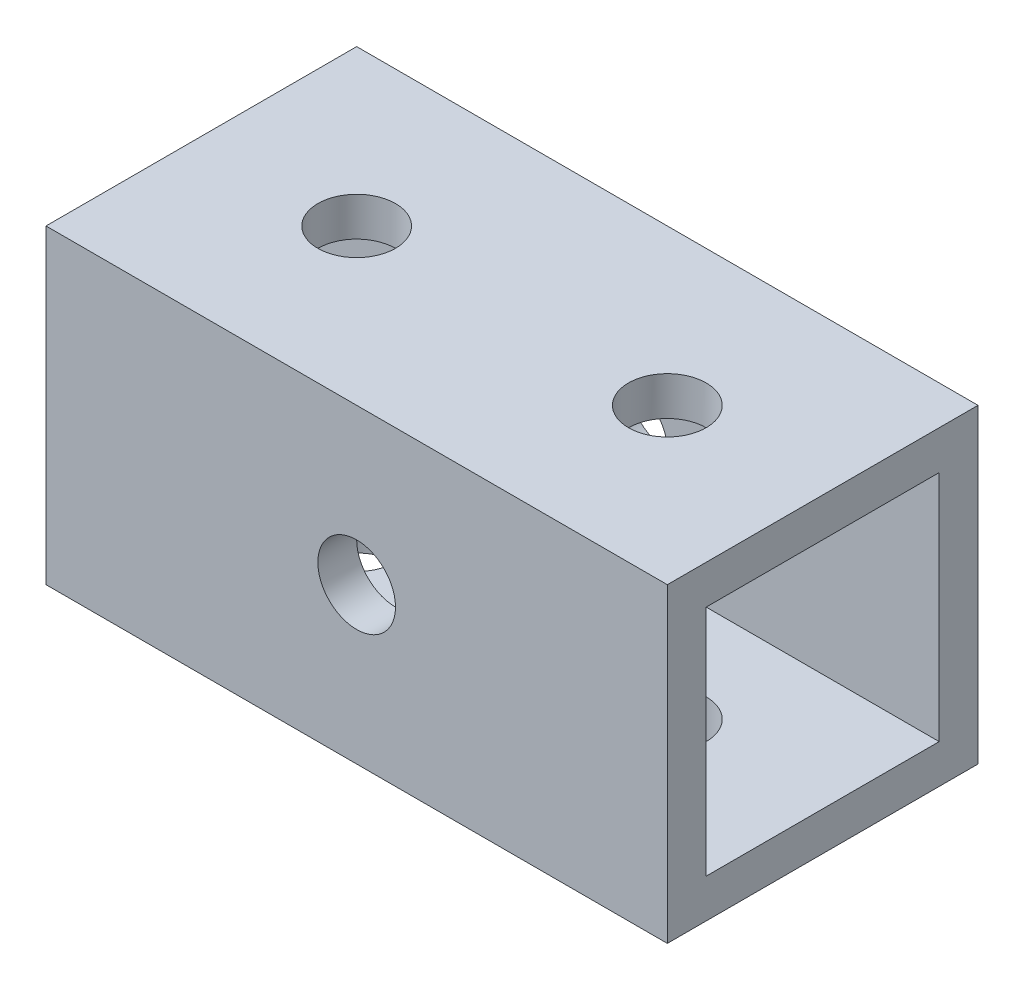
ISO-10303-21;
HEADER;
FILE_DESCRIPTION(('STEP AP214'),'2;1');
FILE_NAME('part.step','',(''),(''),'','','');
FILE_SCHEMA(('AUTOMOTIVE_DESIGN { 1 0 10303 214 1 1 1 1 }'));
ENDSEC;
DATA;
#1=APPLICATION_CONTEXT('core data for automotive mechanical design processes');
#2=APPLICATION_PROTOCOL_DEFINITION('international standard','automotive_design',2000,#1);
#3=PRODUCT_CONTEXT('',#1,'mechanical');
#4=PRODUCT('Part','Part','',(#3));
#5=PRODUCT_RELATED_PRODUCT_CATEGORY('part','',(#4));
#6=PRODUCT_DEFINITION_FORMATION('','',#4);
#7=PRODUCT_DEFINITION_CONTEXT('part definition',#1,'design');
#8=PRODUCT_DEFINITION('design','',#6,#7);
#9=PRODUCT_DEFINITION_SHAPE('','',#8);
#10=(LENGTH_UNIT() NAMED_UNIT(*) SI_UNIT(.MILLI.,.METRE.));
#11=(NAMED_UNIT(*) PLANE_ANGLE_UNIT() SI_UNIT($,.RADIAN.));
#12=(NAMED_UNIT(*) SI_UNIT($,.STERADIAN.) SOLID_ANGLE_UNIT());
#13=UNCERTAINTY_MEASURE_WITH_UNIT(LENGTH_MEASURE(1.E-05),#10,'distance_accuracy_value','');
#14=(GEOMETRIC_REPRESENTATION_CONTEXT(3) GLOBAL_UNCERTAINTY_ASSIGNED_CONTEXT((#13)) GLOBAL_UNIT_ASSIGNED_CONTEXT((#10,
#11,#12)) REPRESENTATION_CONTEXT('',''));
#15=CARTESIAN_POINT('',(0.,0.,0.));
#16=DIRECTION('',(0.,0.,1.));
#17=DIRECTION('',(1.,0.,0.));
#18=AXIS2_PLACEMENT_3D('',#15,#16,#17);
#19=CARTESIAN_POINT('',(50.8,25.4,0.));
#20=DIRECTION('',(-1.,0.,0.));
#21=DIRECTION('',(0.,0.,1.));
#22=AXIS2_PLACEMENT_3D('',#19,#20,#21);
#23=PLANE('',#22);
#24=DIRECTION('',(0.,-1.,0.));
#25=VECTOR('',#24,1.);
#26=CARTESIAN_POINT('',(50.8,0.,0.));
#27=LINE('',#26,#25);
#28=CARTESIAN_POINT('',(50.8,25.4,0.));
#29=VERTEX_POINT('',#28);
#30=CARTESIAN_POINT('',(50.8,0.,0.));
#31=VERTEX_POINT('',#30);
#32=EDGE_CURVE('E147',#29,#31,#27,.T.);
#33=ORIENTED_EDGE('',*,*,#32,.T.);
#34=DIRECTION('',(0.,0.,-1.));
#35=VECTOR('',#34,1.);
#36=CARTESIAN_POINT('',(50.8,0.,0.));
#37=LINE('',#36,#35);
#38=CARTESIAN_POINT('',(50.8,0.,-25.4));
#39=VERTEX_POINT('',#38);
#40=EDGE_CURVE('E150',#31,#39,#37,.T.);
#41=ORIENTED_EDGE('',*,*,#40,.T.);
#42=DIRECTION('',(0.,1.,0.));
#43=VECTOR('',#42,1.);
#44=CARTESIAN_POINT('',(50.8,0.,-25.4));
#45=LINE('',#44,#43);
#46=CARTESIAN_POINT('',(50.8,25.4,-25.4));
#47=VERTEX_POINT('',#46);
#48=EDGE_CURVE('E152',#39,#47,#45,.T.);
#49=ORIENTED_EDGE('',*,*,#48,.T.);
#50=DIRECTION('',(0.,0.,1.));
#51=VECTOR('',#50,1.);
#52=CARTESIAN_POINT('',(50.8,25.4,0.));
#53=LINE('',#52,#51);
#54=EDGE_CURVE('E154',#47,#29,#53,.T.);
#55=ORIENTED_EDGE('',*,*,#54,.T.);
#56=EDGE_LOOP('',(#33,#41,#49,#55));
#57=FACE_BOUND('',#56,.T.);
#58=DIRECTION('',(0.,-1.,0.));
#59=VECTOR('',#58,1.);
#60=CARTESIAN_POINT('',(50.8,3.175,-3.175));
#61=LINE('',#60,#59);
#62=CARTESIAN_POINT('',(50.8,22.225,-3.175));
#63=VERTEX_POINT('',#62);
#64=CARTESIAN_POINT('',(50.8,3.175,-3.175));
#65=VERTEX_POINT('',#64);
#66=EDGE_CURVE('E113',#63,#65,#61,.T.);
#67=ORIENTED_EDGE('',*,*,#66,.F.);
#68=DIRECTION('',(0.,0.,1.));
#69=VECTOR('',#68,1.);
#70=CARTESIAN_POINT('',(50.8,22.225,-3.175));
#71=LINE('',#70,#69);
#72=CARTESIAN_POINT('',(50.8,22.225,-22.225));
#73=VERTEX_POINT('',#72);
#74=EDGE_CURVE('E133',#73,#63,#71,.T.);
#75=ORIENTED_EDGE('',*,*,#74,.F.);
#76=DIRECTION('',(0.,1.,0.));
#77=VECTOR('',#76,1.);
#78=CARTESIAN_POINT('',(50.8,3.175,-22.225));
#79=LINE('',#78,#77);
#80=CARTESIAN_POINT('',(50.8,3.175,-22.225));
#81=VERTEX_POINT('',#80);
#82=EDGE_CURVE('E131',#81,#73,#79,.T.);
#83=ORIENTED_EDGE('',*,*,#82,.F.);
#84=DIRECTION('',(0.,0.,-1.));
#85=VECTOR('',#84,1.);
#86=CARTESIAN_POINT('',(50.8,3.175,-3.175));
#87=LINE('',#86,#85);
#88=EDGE_CURVE('E129',#65,#81,#87,.T.);
#89=ORIENTED_EDGE('',*,*,#88,.F.);
#90=EDGE_LOOP('',(#67,#75,#83,#89));
#91=FACE_BOUND('',#90,.T.);
#92=ADVANCED_FACE('F31',(#57,#91),#23,.F.);
#93=CARTESIAN_POINT('',(0.,25.4,0.));
#94=DIRECTION('',(-1.,0.,0.));
#95=DIRECTION('',(0.,0.,1.));
#96=AXIS2_PLACEMENT_3D('',#93,#94,#95);
#97=PLANE('',#96);
#98=DIRECTION('',(0.,-1.,0.));
#99=VECTOR('',#98,1.);
#100=CARTESIAN_POINT('',(0.,0.,0.));
#101=LINE('',#100,#99);
#102=CARTESIAN_POINT('',(0.,25.4,0.));
#103=VERTEX_POINT('',#102);
#104=CARTESIAN_POINT('',(0.,0.,0.));
#105=VERTEX_POINT('',#104);
#106=EDGE_CURVE('E114',#103,#105,#101,.T.);
#107=ORIENTED_EDGE('',*,*,#106,.F.);
#108=DIRECTION('',(0.,0.,1.));
#109=VECTOR('',#108,1.);
#110=CARTESIAN_POINT('',(0.,25.4,0.));
#111=LINE('',#110,#109);
#112=CARTESIAN_POINT('',(0.,25.4,-25.4));
#113=VERTEX_POINT('',#112);
#114=EDGE_CURVE('E145',#113,#103,#111,.T.);
#115=ORIENTED_EDGE('',*,*,#114,.F.);
#116=DIRECTION('',(0.,1.,0.));
#117=VECTOR('',#116,1.);
#118=CARTESIAN_POINT('',(0.,0.,-25.4));
#119=LINE('',#118,#117);
#120=CARTESIAN_POINT('',(0.,0.,-25.4));
#121=VERTEX_POINT('',#120);
#122=EDGE_CURVE('E143',#121,#113,#119,.T.);
#123=ORIENTED_EDGE('',*,*,#122,.F.);
#124=DIRECTION('',(0.,0.,-1.));
#125=VECTOR('',#124,1.);
#126=CARTESIAN_POINT('',(0.,0.,0.));
#127=LINE('',#126,#125);
#128=EDGE_CURVE('E141',#105,#121,#127,.T.);
#129=ORIENTED_EDGE('',*,*,#128,.F.);
#130=EDGE_LOOP('',(#107,#115,#123,#129));
#131=FACE_BOUND('',#130,.T.);
#132=DIRECTION('',(0.,0.,1.));
#133=VECTOR('',#132,1.);
#134=CARTESIAN_POINT('',(0.,22.225,-3.175));
#135=LINE('',#134,#133);
#136=CARTESIAN_POINT('',(0.,22.225,-22.225));
#137=VERTEX_POINT('',#136);
#138=CARTESIAN_POINT('',(0.,22.225,-3.175));
#139=VERTEX_POINT('',#138);
#140=EDGE_CURVE('E118',#137,#139,#135,.T.);
#141=ORIENTED_EDGE('',*,*,#140,.T.);
#142=DIRECTION('',(0.,-1.,0.));
#143=VECTOR('',#142,1.);
#144=CARTESIAN_POINT('',(0.,3.175,-3.175));
#145=LINE('',#144,#143);
#146=CARTESIAN_POINT('',(0.,3.175,-3.175));
#147=VERTEX_POINT('',#146);
#148=EDGE_CURVE('E56',#139,#147,#145,.T.);
#149=ORIENTED_EDGE('',*,*,#148,.T.);
#150=DIRECTION('',(0.,0.,-1.));
#151=VECTOR('',#150,1.);
#152=CARTESIAN_POINT('',(0.,3.175,-3.175));
#153=LINE('',#152,#151);
#154=CARTESIAN_POINT('',(0.,3.175,-22.225));
#155=VERTEX_POINT('',#154);
#156=EDGE_CURVE('E100',#147,#155,#153,.T.);
#157=ORIENTED_EDGE('',*,*,#156,.T.);
#158=DIRECTION('',(0.,1.,0.));
#159=VECTOR('',#158,1.);
#160=CARTESIAN_POINT('',(0.,3.175,-22.225));
#161=LINE('',#160,#159);
#162=EDGE_CURVE('E109',#155,#137,#161,.T.);
#163=ORIENTED_EDGE('',*,*,#162,.T.);
#164=EDGE_LOOP('',(#141,#149,#157,#163));
#165=FACE_BOUND('',#164,.T.);
#166=ADVANCED_FACE('F117',(#131,#165),#97,.T.);
#167=CARTESIAN_POINT('',(50.8,0.,0.));
#168=DIRECTION('',(0.,0.,-1.));
#169=DIRECTION('',(0.,1.,0.));
#170=AXIS2_PLACEMENT_3D('',#167,#168,#169);
#171=PLANE('',#170);
#172=CARTESIAN_POINT('',(25.4,12.7,0.));
#173=DIRECTION('',(0.,0.,1.));
#174=DIRECTION('',(1.,0.,0.));
#175=AXIS2_PLACEMENT_3D('',#172,#173,#174);
#176=CIRCLE('',#175,3.175);
#177=CARTESIAN_POINT('',(28.575,12.7,0.));
#178=VERTEX_POINT('',#177);
#179=EDGE_CURVE('E173',#178,#178,#176,.T.);
#180=ORIENTED_EDGE('',*,*,#179,.F.);
#181=EDGE_LOOP('',(#180));
#182=FACE_BOUND('',#181,.T.);
#183=ORIENTED_EDGE('',*,*,#106,.T.);
#184=DIRECTION('',(-1.,0.,0.));
#185=VECTOR('',#184,1.);
#186=CARTESIAN_POINT('',(50.8,0.,0.));
#187=LINE('',#186,#185);
#188=EDGE_CURVE('E11',#31,#105,#187,.T.);
#189=ORIENTED_EDGE('',*,*,#188,.F.);
#190=ORIENTED_EDGE('',*,*,#32,.F.);
#191=DIRECTION('',(-1.,0.,0.));
#192=VECTOR('',#191,1.);
#193=CARTESIAN_POINT('',(50.8,25.4,0.));
#194=LINE('',#193,#192);
#195=EDGE_CURVE('E156',#29,#103,#194,.T.);
#196=ORIENTED_EDGE('',*,*,#195,.T.);
#197=EDGE_LOOP('',(#183,#189,#190,#196));
#198=FACE_BOUND('',#197,.T.);
#199=ADVANCED_FACE('F33',(#182,#198),#171,.F.);
#200=CARTESIAN_POINT('',(50.8,0.,0.));
#201=DIRECTION('',(0.,1.,0.));
#202=DIRECTION('',(0.,0.,1.));
#203=AXIS2_PLACEMENT_3D('',#200,#201,#202);
#204=PLANE('',#203);
#205=CARTESIAN_POINT('',(12.7,0.,-12.7));
#206=DIRECTION('',(0.,1.,0.));
#207=DIRECTION('',(0.,0.,-1.));
#208=AXIS2_PLACEMENT_3D('',#205,#206,#207);
#209=CIRCLE('',#208,3.175);
#210=CARTESIAN_POINT('',(12.7,0.,-15.875));
#211=VERTEX_POINT('',#210);
#212=EDGE_CURVE('E233',#211,#211,#209,.T.);
#213=ORIENTED_EDGE('',*,*,#212,.T.);
#214=EDGE_LOOP('',(#213));
#215=FACE_BOUND('',#214,.T.);
#216=CARTESIAN_POINT('',(38.1,0.,-12.7));
#217=DIRECTION('',(0.,1.,0.));
#218=DIRECTION('',(0.,0.,1.));
#219=AXIS2_PLACEMENT_3D('',#216,#217,#218);
#220=CIRCLE('',#219,3.175);
#221=CARTESIAN_POINT('',(38.1,0.,-9.525));
#222=VERTEX_POINT('',#221);
#223=EDGE_CURVE('E169',#222,#222,#220,.T.);
#224=ORIENTED_EDGE('',*,*,#223,.T.);
#225=EDGE_LOOP('',(#224));
#226=FACE_BOUND('',#225,.T.);
#227=ORIENTED_EDGE('',*,*,#128,.T.);
#228=DIRECTION('',(-1.,0.,0.));
#229=VECTOR('',#228,1.);
#230=CARTESIAN_POINT('',(50.8,0.,-25.4));
#231=LINE('',#230,#229);
#232=EDGE_CURVE('E40',#39,#121,#231,.T.);
#233=ORIENTED_EDGE('',*,*,#232,.F.);
#234=ORIENTED_EDGE('',*,*,#40,.F.);
#235=ORIENTED_EDGE('',*,*,#188,.T.);
#236=EDGE_LOOP('',(#227,#233,#234,#235));
#237=FACE_BOUND('',#236,.T.);
#238=ADVANCED_FACE('F224',(#215,#226,#237),#204,.F.);
#239=CARTESIAN_POINT('',(50.8,0.,-25.4));
#240=DIRECTION('',(0.,0.,1.));
#241=DIRECTION('',(0.,-1.,0.));
#242=AXIS2_PLACEMENT_3D('',#239,#240,#241);
#243=PLANE('',#242);
#244=CARTESIAN_POINT('',(25.4,12.7,-25.4));
#245=DIRECTION('',(0.,0.,1.));
#246=DIRECTION('',(1.,0.,0.));
#247=AXIS2_PLACEMENT_3D('',#244,#245,#246);
#248=CIRCLE('',#247,3.175);
#249=CARTESIAN_POINT('',(28.575,12.7,-25.4));
#250=VERTEX_POINT('',#249);
#251=EDGE_CURVE('E165',#250,#250,#248,.T.);
#252=ORIENTED_EDGE('',*,*,#251,.T.);
#253=EDGE_LOOP('',(#252));
#254=FACE_BOUND('',#253,.T.);
#255=ORIENTED_EDGE('',*,*,#122,.T.);
#256=DIRECTION('',(-1.,0.,0.));
#257=VECTOR('',#256,1.);
#258=CARTESIAN_POINT('',(50.8,25.4,-25.4));
#259=LINE('',#258,#257);
#260=EDGE_CURVE('E159',#47,#113,#259,.T.);
#261=ORIENTED_EDGE('',*,*,#260,.F.);
#262=ORIENTED_EDGE('',*,*,#48,.F.);
#263=ORIENTED_EDGE('',*,*,#232,.T.);
#264=EDGE_LOOP('',(#255,#261,#262,#263));
#265=FACE_BOUND('',#264,.T.);
#266=ADVANCED_FACE('F189',(#254,#265),#243,.F.);
#267=CARTESIAN_POINT('',(50.8,25.4,0.));
#268=DIRECTION('',(0.,-1.,0.));
#269=DIRECTION('',(0.,0.,-1.));
#270=AXIS2_PLACEMENT_3D('',#267,#268,#269);
#271=PLANE('',#270);
#272=CARTESIAN_POINT('',(12.7,25.4,-12.7));
#273=DIRECTION('',(0.,1.,0.));
#274=DIRECTION('',(0.,0.,-1.));
#275=AXIS2_PLACEMENT_3D('',#272,#273,#274);
#276=CIRCLE('',#275,3.175);
#277=CARTESIAN_POINT('',(12.7,25.4,-15.875));
#278=VERTEX_POINT('',#277);
#279=EDGE_CURVE('E248',#278,#278,#276,.T.);
#280=ORIENTED_EDGE('',*,*,#279,.F.);
#281=EDGE_LOOP('',(#280));
#282=FACE_BOUND('',#281,.T.);
#283=CARTESIAN_POINT('',(38.1,25.4,-12.7));
#284=DIRECTION('',(0.,1.,0.));
#285=DIRECTION('',(0.,0.,1.));
#286=AXIS2_PLACEMENT_3D('',#283,#284,#285);
#287=CIRCLE('',#286,3.175);
#288=CARTESIAN_POINT('',(38.1,25.4,-9.525));
#289=VERTEX_POINT('',#288);
#290=EDGE_CURVE('E176',#289,#289,#287,.T.);
#291=ORIENTED_EDGE('',*,*,#290,.F.);
#292=EDGE_LOOP('',(#291));
#293=FACE_BOUND('',#292,.T.);
#294=ORIENTED_EDGE('',*,*,#114,.T.);
#295=ORIENTED_EDGE('',*,*,#195,.F.);
#296=ORIENTED_EDGE('',*,*,#54,.F.);
#297=ORIENTED_EDGE('',*,*,#260,.T.);
#298=EDGE_LOOP('',(#294,#295,#296,#297));
#299=FACE_BOUND('',#298,.T.);
#300=ADVANCED_FACE('F219',(#282,#293,#299),#271,.F.);
#301=CARTESIAN_POINT('',(50.8,3.175,-3.175));
#302=DIRECTION('',(0.,0.,-1.));
#303=DIRECTION('',(-1.,0.,0.));
#304=AXIS2_PLACEMENT_3D('',#301,#302,#303);
#305=PLANE('',#304);
#306=CARTESIAN_POINT('',(25.4,12.7,-3.175));
#307=DIRECTION('',(0.,0.,-1.));
#308=DIRECTION('',(-1.,0.,0.));
#309=AXIS2_PLACEMENT_3D('',#306,#307,#308);
#310=CIRCLE('',#309,3.175);
#311=CARTESIAN_POINT('',(22.225,12.7,-3.175));
#312=VERTEX_POINT('',#311);
#313=EDGE_CURVE('E119',#312,#312,#310,.T.);
#314=ORIENTED_EDGE('',*,*,#313,.F.);
#315=EDGE_LOOP('',(#314));
#316=FACE_BOUND('',#315,.T.);
#317=ORIENTED_EDGE('',*,*,#148,.F.);
#318=DIRECTION('',(-1.,0.,0.));
#319=VECTOR('',#318,1.);
#320=CARTESIAN_POINT('',(50.8,22.225,-3.175));
#321=LINE('',#320,#319);
#322=EDGE_CURVE('E135',#63,#139,#321,.T.);
#323=ORIENTED_EDGE('',*,*,#322,.F.);
#324=ORIENTED_EDGE('',*,*,#66,.T.);
#325=DIRECTION('',(-1.,0.,0.));
#326=VECTOR('',#325,1.);
#327=CARTESIAN_POINT('',(50.8,3.175,-3.175));
#328=LINE('',#327,#326);
#329=EDGE_CURVE('E102',#65,#147,#328,.T.);
#330=ORIENTED_EDGE('',*,*,#329,.T.);
#331=EDGE_LOOP('',(#317,#323,#324,#330));
#332=FACE_BOUND('',#331,.T.);
#333=ADVANCED_FACE('F111',(#316,#332),#305,.T.);
#334=CARTESIAN_POINT('',(50.8,3.175,-3.175));
#335=DIRECTION('',(0.,1.,0.));
#336=DIRECTION('',(0.,0.,1.));
#337=AXIS2_PLACEMENT_3D('',#334,#335,#336);
#338=PLANE('',#337);
#339=CARTESIAN_POINT('',(12.7,3.175,-12.7));
#340=DIRECTION('',(0.,1.,0.));
#341=DIRECTION('',(0.,0.,1.));
#342=AXIS2_PLACEMENT_3D('',#339,#340,#341);
#343=CIRCLE('',#342,3.175);
#344=CARTESIAN_POINT('',(12.7,3.175,-9.525));
#345=VERTEX_POINT('',#344);
#346=EDGE_CURVE('E181',#345,#345,#343,.T.);
#347=ORIENTED_EDGE('',*,*,#346,.F.);
#348=EDGE_LOOP('',(#347));
#349=FACE_BOUND('',#348,.T.);
#350=CARTESIAN_POINT('',(38.1,3.175,-12.7));
#351=DIRECTION('',(0.,1.,0.));
#352=DIRECTION('',(0.,0.,1.));
#353=AXIS2_PLACEMENT_3D('',#350,#351,#352);
#354=CIRCLE('',#353,3.175);
#355=CARTESIAN_POINT('',(38.1,3.175,-9.525));
#356=VERTEX_POINT('',#355);
#357=EDGE_CURVE('E168',#356,#356,#354,.T.);
#358=ORIENTED_EDGE('',*,*,#357,.F.);
#359=EDGE_LOOP('',(#358));
#360=FACE_BOUND('',#359,.T.);
#361=ORIENTED_EDGE('',*,*,#156,.F.);
#362=ORIENTED_EDGE('',*,*,#329,.F.);
#363=ORIENTED_EDGE('',*,*,#88,.T.);
#364=DIRECTION('',(-1.,0.,0.));
#365=VECTOR('',#364,1.);
#366=CARTESIAN_POINT('',(50.8,3.175,-22.225));
#367=LINE('',#366,#365);
#368=EDGE_CURVE('E105',#81,#155,#367,.T.);
#369=ORIENTED_EDGE('',*,*,#368,.T.);
#370=EDGE_LOOP('',(#361,#362,#363,#369));
#371=FACE_BOUND('',#370,.T.);
#372=ADVANCED_FACE('F101',(#349,#360,#371),#338,.T.);
#373=CARTESIAN_POINT('',(50.8,3.175,-22.225));
#374=DIRECTION('',(0.,0.,1.));
#375=DIRECTION('',(1.,0.,0.));
#376=AXIS2_PLACEMENT_3D('',#373,#374,#375);
#377=PLANE('',#376);
#378=CARTESIAN_POINT('',(25.4,12.7,-22.225));
#379=DIRECTION('',(0.,0.,1.));
#380=DIRECTION('',(1.,0.,0.));
#381=AXIS2_PLACEMENT_3D('',#378,#379,#380);
#382=CIRCLE('',#381,3.175);
#383=CARTESIAN_POINT('',(28.575,12.7,-22.225));
#384=VERTEX_POINT('',#383);
#385=EDGE_CURVE('E122',#384,#384,#382,.T.);
#386=ORIENTED_EDGE('',*,*,#385,.F.);
#387=EDGE_LOOP('',(#386));
#388=FACE_BOUND('',#387,.T.);
#389=ORIENTED_EDGE('',*,*,#162,.F.);
#390=ORIENTED_EDGE('',*,*,#368,.F.);
#391=ORIENTED_EDGE('',*,*,#82,.T.);
#392=DIRECTION('',(-1.,0.,0.));
#393=VECTOR('',#392,1.);
#394=CARTESIAN_POINT('',(50.8,22.225,-22.225));
#395=LINE('',#394,#393);
#396=EDGE_CURVE('E48',#73,#137,#395,.T.);
#397=ORIENTED_EDGE('',*,*,#396,.T.);
#398=EDGE_LOOP('',(#389,#390,#391,#397));
#399=FACE_BOUND('',#398,.T.);
#400=ADVANCED_FACE('F204',(#388,#399),#377,.T.);
#401=CARTESIAN_POINT('',(50.8,22.225,-3.175));
#402=DIRECTION('',(0.,-1.,0.));
#403=DIRECTION('',(0.,0.,-1.));
#404=AXIS2_PLACEMENT_3D('',#401,#402,#403);
#405=PLANE('',#404);
#406=CARTESIAN_POINT('',(12.7,22.225,-12.7));
#407=DIRECTION('',(0.,-1.,0.));
#408=DIRECTION('',(0.,0.,-1.));
#409=AXIS2_PLACEMENT_3D('',#406,#407,#408);
#410=CIRCLE('',#409,3.175);
#411=CARTESIAN_POINT('',(12.7,22.225,-15.875));
#412=VERTEX_POINT('',#411);
#413=EDGE_CURVE('E35',#412,#412,#410,.T.);
#414=ORIENTED_EDGE('',*,*,#413,.F.);
#415=EDGE_LOOP('',(#414));
#416=FACE_BOUND('',#415,.T.);
#417=CARTESIAN_POINT('',(38.1,22.225,-12.7));
#418=DIRECTION('',(0.,-1.,0.));
#419=DIRECTION('',(0.,0.,-1.));
#420=AXIS2_PLACEMENT_3D('',#417,#418,#419);
#421=CIRCLE('',#420,3.175);
#422=CARTESIAN_POINT('',(38.1,22.225,-15.875));
#423=VERTEX_POINT('',#422);
#424=EDGE_CURVE('E166',#423,#423,#421,.T.);
#425=ORIENTED_EDGE('',*,*,#424,.F.);
#426=EDGE_LOOP('',(#425));
#427=FACE_BOUND('',#426,.T.);
#428=ORIENTED_EDGE('',*,*,#140,.F.);
#429=ORIENTED_EDGE('',*,*,#396,.F.);
#430=ORIENTED_EDGE('',*,*,#74,.T.);
#431=ORIENTED_EDGE('',*,*,#322,.T.);
#432=EDGE_LOOP('',(#428,#429,#430,#431));
#433=FACE_BOUND('',#432,.T.);
#434=ADVANCED_FACE('F195',(#416,#427,#433),#405,.T.);
#435=CARTESIAN_POINT('',(25.4,12.7,-25.4));
#436=DIRECTION('',(0.,0.,1.));
#437=DIRECTION('',(1.,0.,0.));
#438=AXIS2_PLACEMENT_3D('',#435,#436,#437);
#439=CYLINDRICAL_SURFACE('',#438,3.175);
#440=ORIENTED_EDGE('',*,*,#385,.T.);
#441=EDGE_LOOP('',(#440));
#442=FACE_BOUND('',#441,.T.);
#443=ORIENTED_EDGE('',*,*,#251,.F.);
#444=EDGE_LOOP('',(#443));
#445=FACE_BOUND('',#444,.T.);
#446=ADVANCED_FACE('F192',(#442,#445),#439,.F.);
#447=ORIENTED_EDGE('',*,*,#313,.T.);
#448=EDGE_LOOP('',(#447));
#449=FACE_BOUND('',#448,.T.);
#450=ORIENTED_EDGE('',*,*,#179,.T.);
#451=EDGE_LOOP('',(#450));
#452=FACE_BOUND('',#451,.T.);
#453=ADVANCED_FACE('F194',(#449,#452),#439,.F.);
#454=CARTESIAN_POINT('',(38.1,0.,-12.7));
#455=DIRECTION('',(0.,1.,0.));
#456=DIRECTION('',(0.,0.,1.));
#457=AXIS2_PLACEMENT_3D('',#454,#455,#456);
#458=CYLINDRICAL_SURFACE('',#457,3.175);
#459=ORIENTED_EDGE('',*,*,#424,.T.);
#460=EDGE_LOOP('',(#459));
#461=FACE_BOUND('',#460,.T.);
#462=ORIENTED_EDGE('',*,*,#290,.T.);
#463=EDGE_LOOP('',(#462));
#464=FACE_BOUND('',#463,.T.);
#465=ADVANCED_FACE('F202',(#461,#464),#458,.F.);
#466=ORIENTED_EDGE('',*,*,#357,.T.);
#467=EDGE_LOOP('',(#466));
#468=FACE_BOUND('',#467,.T.);
#469=ORIENTED_EDGE('',*,*,#223,.F.);
#470=EDGE_LOOP('',(#469));
#471=FACE_BOUND('',#470,.T.);
#472=ADVANCED_FACE('F263',(#468,#471),#458,.F.);
#473=CARTESIAN_POINT('',(12.7,0.,-12.7));
#474=DIRECTION('',(0.,1.,0.));
#475=DIRECTION('',(0.,0.,1.));
#476=AXIS2_PLACEMENT_3D('',#473,#474,#475);
#477=CYLINDRICAL_SURFACE('',#476,3.175);
#478=ORIENTED_EDGE('',*,*,#413,.T.);
#479=EDGE_LOOP('',(#478));
#480=FACE_BOUND('',#479,.T.);
#481=ORIENTED_EDGE('',*,*,#279,.T.);
#482=EDGE_LOOP('',(#481));
#483=FACE_BOUND('',#482,.T.);
#484=ADVANCED_FACE('F266',(#480,#483),#477,.F.);
#485=ORIENTED_EDGE('',*,*,#346,.T.);
#486=EDGE_LOOP('',(#485));
#487=FACE_BOUND('',#486,.T.);
#488=ORIENTED_EDGE('',*,*,#212,.F.);
#489=EDGE_LOOP('',(#488));
#490=FACE_BOUND('',#489,.T.);
#491=ADVANCED_FACE('F256',(#487,#490),#477,.F.);
#492=CLOSED_SHELL('',(#92,#166,#199,#238,#266,#300,#333,#372,#400,#434,#446,#453,#465,#472,#484,#491));
#493=MANIFOLD_SOLID_BREP('B2',#492);
#494=ADVANCED_BREP_SHAPE_REPRESENTATION('',(#18,#493),#14);
#495=SHAPE_DEFINITION_REPRESENTATION(#9,#494);
ENDSEC;
END-ISO-10303-21;
